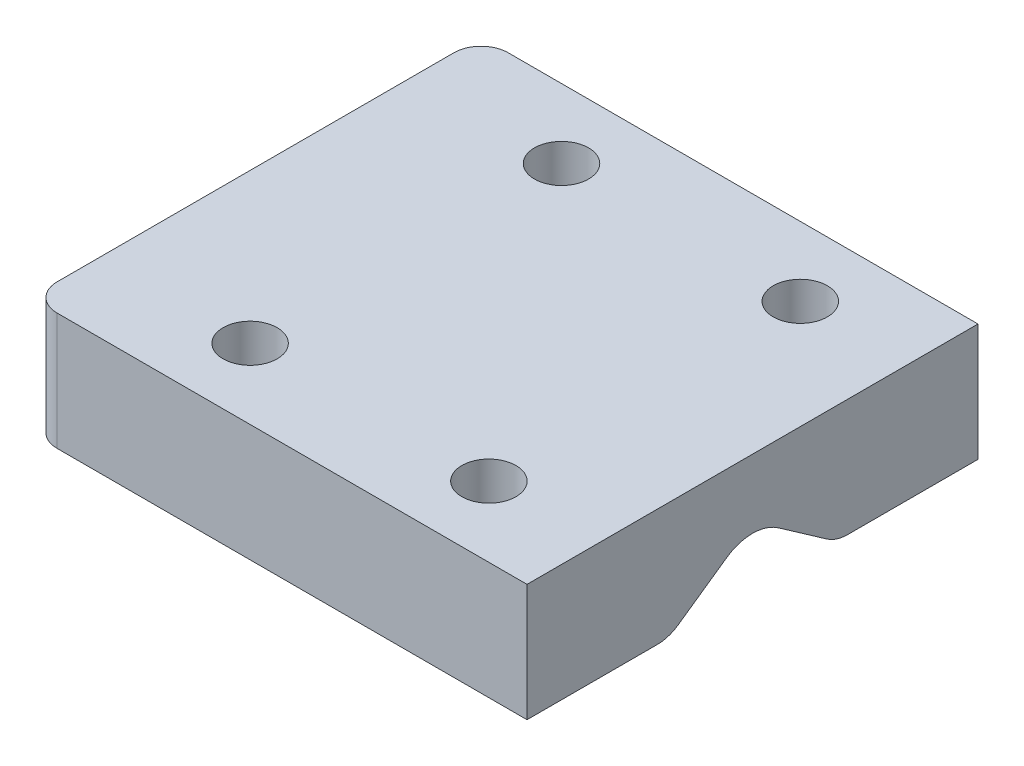
ISO-10303-21;
HEADER;
FILE_DESCRIPTION(('STEP AP214'),'2;1');
FILE_NAME('part.step','',(''),(''),'','','');
FILE_SCHEMA(('AUTOMOTIVE_DESIGN { 1 0 10303 214 1 1 1 1 }'));
ENDSEC;
DATA;
#1=APPLICATION_CONTEXT('core data for automotive mechanical design processes');
#2=APPLICATION_PROTOCOL_DEFINITION('international standard','automotive_design',2000,#1);
#3=PRODUCT_CONTEXT('',#1,'mechanical');
#4=PRODUCT('Part','Part','',(#3));
#5=PRODUCT_RELATED_PRODUCT_CATEGORY('part','',(#4));
#6=PRODUCT_DEFINITION_FORMATION('','',#4);
#7=PRODUCT_DEFINITION_CONTEXT('part definition',#1,'design');
#8=PRODUCT_DEFINITION('design','',#6,#7);
#9=PRODUCT_DEFINITION_SHAPE('','',#8);
#10=(LENGTH_UNIT() NAMED_UNIT(*) SI_UNIT(.MILLI.,.METRE.));
#11=(NAMED_UNIT(*) PLANE_ANGLE_UNIT() SI_UNIT($,.RADIAN.));
#12=(NAMED_UNIT(*) SI_UNIT($,.STERADIAN.) SOLID_ANGLE_UNIT());
#13=UNCERTAINTY_MEASURE_WITH_UNIT(LENGTH_MEASURE(1.E-05),#10,'distance_accuracy_value','');
#14=(GEOMETRIC_REPRESENTATION_CONTEXT(3) GLOBAL_UNCERTAINTY_ASSIGNED_CONTEXT((#13)) GLOBAL_UNIT_ASSIGNED_CONTEXT((#10,
#11,#12)) REPRESENTATION_CONTEXT('',''));
#15=CARTESIAN_POINT('',(0.,0.,0.));
#16=DIRECTION('',(0.,0.,1.));
#17=DIRECTION('',(1.,0.,0.));
#18=AXIS2_PLACEMENT_3D('',#15,#16,#17);
#19=CARTESIAN_POINT('',(0.,68.,0.));
#20=DIRECTION('',(0.,-1.,0.));
#21=DIRECTION('',(0.,0.,-1.));
#22=AXIS2_PLACEMENT_3D('',#19,#20,#21);
#23=PLANE('',#22);
#24=CARTESIAN_POINT('',(15.4737437034702,68.,-17.3243369322658));
#25=DIRECTION('',(0.,1.,0.));
#26=DIRECTION('',(0.,0.,1.));
#27=AXIS2_PLACEMENT_3D('',#24,#25,#26);
#28=CIRCLE('',#27,3.);
#29=CARTESIAN_POINT('',(15.4737437034702,68.,-14.3243369322658));
#30=VERTEX_POINT('',#29);
#31=EDGE_CURVE('E244',#30,#30,#28,.T.);
#32=ORIENTED_EDGE('',*,*,#31,.T.);
#33=EDGE_LOOP('',(#32));
#34=FACE_BOUND('',#33,.T.);
#35=CARTESIAN_POINT('',(-11.,68.,-17.3243369322658));
#36=DIRECTION('',(0.,1.,0.));
#37=DIRECTION('',(0.,0.,1.));
#38=AXIS2_PLACEMENT_3D('',#35,#36,#37);
#39=CIRCLE('',#38,3.);
#40=CARTESIAN_POINT('',(-11.,68.,-14.3243369322658));
#41=VERTEX_POINT('',#40);
#42=EDGE_CURVE('E245',#41,#41,#39,.T.);
#43=ORIENTED_EDGE('',*,*,#42,.T.);
#44=EDGE_LOOP('',(#43));
#45=FACE_BOUND('',#44,.T.);
#46=DIRECTION('',(0.,0.,-1.));
#47=VECTOR('',#46,1.);
#48=CARTESIAN_POINT('',(27.5,68.,-25.));
#49=LINE('',#48,#47);
#50=CARTESIAN_POINT('',(27.5,68.,-10.5441571993397));
#51=VERTEX_POINT('',#50);
#52=CARTESIAN_POINT('',(27.5,68.,-25.));
#53=VERTEX_POINT('',#52);
#54=EDGE_CURVE('E149',#51,#53,#49,.T.);
#55=ORIENTED_EDGE('',*,*,#54,.F.);
#56=DIRECTION('',(1.,0.,0.));
#57=VECTOR('',#56,1.);
#58=CARTESIAN_POINT('',(-27.5972353458108,68.,-10.5441571993397));
#59=LINE('',#58,#57);
#60=CARTESIAN_POINT('',(-27.5972353458108,68.,-10.5441571993397));
#61=VERTEX_POINT('',#60);
#62=EDGE_CURVE('E192',#51,#61,#59,.F.);
#63=ORIENTED_EDGE('',*,*,#62,.T.);
#64=DIRECTION('',(0.,0.,1.));
#65=VECTOR('',#64,1.);
#66=CARTESIAN_POINT('',(-27.5972353458108,68.,-25.));
#67=LINE('',#66,#65);
#68=CARTESIAN_POINT('',(-27.5972353458108,68.,-22.));
#69=VERTEX_POINT('',#68);
#70=EDGE_CURVE('E214',#69,#61,#67,.T.);
#71=ORIENTED_EDGE('',*,*,#70,.F.);
#72=CARTESIAN_POINT('',(-24.5972353458108,68.,-22.));
#73=DIRECTION('',(0.,-1.,0.));
#74=DIRECTION('',(0.,0.,-1.));
#75=AXIS2_PLACEMENT_3D('',#72,#73,#74);
#76=CIRCLE('',#75,3.);
#77=CARTESIAN_POINT('',(-24.5972353458108,68.,-25.));
#78=VERTEX_POINT('',#77);
#79=EDGE_CURVE('E171',#69,#78,#76,.T.);
#80=ORIENTED_EDGE('',*,*,#79,.T.);
#81=DIRECTION('',(-1.,0.,0.));
#82=VECTOR('',#81,1.);
#83=CARTESIAN_POINT('',(27.5,68.,-25.));
#84=LINE('',#83,#82);
#85=EDGE_CURVE('E207',#53,#78,#84,.T.);
#86=ORIENTED_EDGE('',*,*,#85,.F.);
#87=EDGE_LOOP('',(#55,#63,#71,#80,#86));
#88=FACE_BOUND('',#87,.T.);
#89=ADVANCED_FACE('F34',(#34,#45,#88),#23,.T.);
#90=CARTESIAN_POINT('',(27.5,81.,-25.));
#91=DIRECTION('',(-1.,0.,0.));
#92=DIRECTION('',(0.,0.,1.));
#93=AXIS2_PLACEMENT_3D('',#90,#91,#92);
#94=PLANE('',#93);
#95=DIRECTION('',(0.,0.573576436351044,0.819152044288993));
#96=VECTOR('',#95,1.);
#97=CARTESIAN_POINT('',(27.5,74.5,0.));
#98=LINE('',#97,#96);
#99=CARTESIAN_POINT('',(27.5,68.723391822844,-8.24985145393554));
#100=VERTEX_POINT('',#99);
#101=CARTESIAN_POINT('',(27.5,72.4918872776377,-2.86788218175522));
#102=VERTEX_POINT('',#101);
#103=EDGE_CURVE('E230',#100,#102,#98,.T.);
#104=ORIENTED_EDGE('',*,*,#103,.F.);
#105=CARTESIAN_POINT('',(27.5,72.,-10.5441571993397));
#106=DIRECTION('',(-1.,0.,0.));
#107=DIRECTION('',(0.,0.,1.));
#108=AXIS2_PLACEMENT_3D('',#105,#106,#107);
#109=CIRCLE('',#108,4.);
#110=EDGE_CURVE('E190',#100,#51,#109,.F.);
#111=ORIENTED_EDGE('',*,*,#110,.T.);
#112=ORIENTED_EDGE('',*,*,#54,.T.);
#113=DIRECTION('',(0.,-1.,0.));
#114=VECTOR('',#113,1.);
#115=CARTESIAN_POINT('',(27.5,81.,-25.));
#116=LINE('',#115,#114);
#117=CARTESIAN_POINT('',(27.5,81.,-25.));
#118=VERTEX_POINT('',#117);
#119=EDGE_CURVE('E128',#118,#53,#116,.T.);
#120=ORIENTED_EDGE('',*,*,#119,.F.);
#121=DIRECTION('',(0.,0.,-1.));
#122=VECTOR('',#121,1.);
#123=CARTESIAN_POINT('',(27.5,81.,-25.));
#124=LINE('',#123,#122);
#125=CARTESIAN_POINT('',(27.5,81.,25.));
#126=VERTEX_POINT('',#125);
#127=EDGE_CURVE('E134',#126,#118,#124,.T.);
#128=ORIENTED_EDGE('',*,*,#127,.F.);
#129=DIRECTION('',(0.,-1.,0.));
#130=VECTOR('',#129,1.);
#131=CARTESIAN_POINT('',(27.5,81.,25.));
#132=LINE('',#131,#130);
#133=CARTESIAN_POINT('',(27.5,68.,25.));
#134=VERTEX_POINT('',#133);
#135=EDGE_CURVE('E152',#126,#134,#132,.T.);
#136=ORIENTED_EDGE('',*,*,#135,.T.);
#137=CARTESIAN_POINT('',(27.5,68.,10.5441571993397));
#138=VERTEX_POINT('',#137);
#139=EDGE_CURVE('E203',#134,#138,#49,.T.);
#140=ORIENTED_EDGE('',*,*,#139,.T.);
#141=CARTESIAN_POINT('',(27.5,72.,10.5441571993397));
#142=DIRECTION('',(-1.,0.,0.));
#143=DIRECTION('',(0.,0.,1.));
#144=AXIS2_PLACEMENT_3D('',#141,#142,#143);
#145=CIRCLE('',#144,4.);
#146=CARTESIAN_POINT('',(27.5,68.723391822844,8.24985145393554));
#147=VERTEX_POINT('',#146);
#148=EDGE_CURVE('E188',#138,#147,#145,.F.);
#149=ORIENTED_EDGE('',*,*,#148,.T.);
#150=DIRECTION('',(0.,-0.573576436351044,0.819152044288993));
#151=VECTOR('',#150,1.);
#152=CARTESIAN_POINT('',(27.5,74.5,0.));
#153=LINE('',#152,#151);
#154=CARTESIAN_POINT('',(27.5,72.4918872776377,2.86788218175521));
#155=VERTEX_POINT('',#154);
#156=EDGE_CURVE('E227',#155,#147,#153,.T.);
#157=ORIENTED_EDGE('',*,*,#156,.F.);
#158=CARTESIAN_POINT('',(27.5,68.3961270561927,0.));
#159=DIRECTION('',(-1.,0.,0.));
#160=DIRECTION('',(0.,0.,1.));
#161=AXIS2_PLACEMENT_3D('',#158,#159,#160);
#162=CIRCLE('',#161,5.);
#163=EDGE_CURVE('E180',#155,#102,#162,.T.);
#164=ORIENTED_EDGE('',*,*,#163,.T.);
#165=EDGE_LOOP('',(#104,#111,#112,#120,#128,#136,#140,#149,#157,#164));
#166=FACE_BOUND('',#165,.T.);
#167=ADVANCED_FACE('F147',(#166),#94,.F.);
#168=CARTESIAN_POINT('',(27.5,81.,-25.));
#169=DIRECTION('',(0.,0.,1.));
#170=DIRECTION('',(1.,0.,0.));
#171=AXIS2_PLACEMENT_3D('',#168,#169,#170);
#172=PLANE('',#171);
#173=ORIENTED_EDGE('',*,*,#85,.T.);
#174=DIRECTION('',(0.,-1.,0.));
#175=VECTOR('',#174,1.);
#176=CARTESIAN_POINT('',(-24.5972353458108,81.,-25.));
#177=LINE('',#176,#175);
#178=CARTESIAN_POINT('',(-24.5972353458108,81.,-25.));
#179=VERTEX_POINT('',#178);
#180=EDGE_CURVE('E130',#78,#179,#177,.F.);
#181=ORIENTED_EDGE('',*,*,#180,.T.);
#182=DIRECTION('',(-1.,0.,0.));
#183=VECTOR('',#182,1.);
#184=CARTESIAN_POINT('',(27.5,81.,-25.));
#185=LINE('',#184,#183);
#186=EDGE_CURVE('E123',#118,#179,#185,.T.);
#187=ORIENTED_EDGE('',*,*,#186,.F.);
#188=ORIENTED_EDGE('',*,*,#119,.T.);
#189=EDGE_LOOP('',(#173,#181,#187,#188));
#190=FACE_BOUND('',#189,.T.);
#191=ADVANCED_FACE('F126',(#190),#172,.F.);
#192=CARTESIAN_POINT('',(-27.5972353458108,81.,-25.));
#193=DIRECTION('',(1.,0.,0.));
#194=DIRECTION('',(0.,0.,-1.));
#195=AXIS2_PLACEMENT_3D('',#192,#193,#194);
#196=PLANE('',#195);
#197=ORIENTED_EDGE('',*,*,#70,.T.);
#198=CARTESIAN_POINT('',(-27.5972353458108,72.,-10.5441571993397));
#199=DIRECTION('',(1.,0.,0.));
#200=DIRECTION('',(0.,0.,-1.));
#201=AXIS2_PLACEMENT_3D('',#198,#199,#200);
#202=CIRCLE('',#201,4.);
#203=CARTESIAN_POINT('',(-27.5972353458108,68.723391822844,-8.24985145393553));
#204=VERTEX_POINT('',#203);
#205=EDGE_CURVE('E195',#61,#204,#202,.F.);
#206=ORIENTED_EDGE('',*,*,#205,.T.);
#207=DIRECTION('',(0.,0.573576436351044,0.819152044288993));
#208=VECTOR('',#207,1.);
#209=CARTESIAN_POINT('',(-27.5972353458108,74.5,0.));
#210=LINE('',#209,#208);
#211=CARTESIAN_POINT('',(-27.5972353458108,72.4918872776377,-2.86788218175521));
#212=VERTEX_POINT('',#211);
#213=EDGE_CURVE('E229',#204,#212,#210,.T.);
#214=ORIENTED_EDGE('',*,*,#213,.T.);
#215=CARTESIAN_POINT('',(-27.5972353458108,68.3961270561927,0.));
#216=DIRECTION('',(1.,0.,0.));
#217=DIRECTION('',(0.,0.,-1.));
#218=AXIS2_PLACEMENT_3D('',#215,#216,#217);
#219=CIRCLE('',#218,5.);
#220=CARTESIAN_POINT('',(-27.5972353458108,72.4918872776377,2.86788218175522));
#221=VERTEX_POINT('',#220);
#222=EDGE_CURVE('E183',#212,#221,#219,.T.);
#223=ORIENTED_EDGE('',*,*,#222,.T.);
#224=DIRECTION('',(0.,-0.573576436351044,0.819152044288993));
#225=VECTOR('',#224,1.);
#226=CARTESIAN_POINT('',(-27.5972353458108,74.5,0.));
#227=LINE('',#226,#225);
#228=CARTESIAN_POINT('',(-27.5972353458108,68.723391822844,8.24985145393554));
#229=VERTEX_POINT('',#228);
#230=EDGE_CURVE('E210',#221,#229,#227,.T.);
#231=ORIENTED_EDGE('',*,*,#230,.T.);
#232=CARTESIAN_POINT('',(-27.5972353458108,72.,10.5441571993397));
#233=DIRECTION('',(1.,0.,0.));
#234=DIRECTION('',(0.,0.,-1.));
#235=AXIS2_PLACEMENT_3D('',#232,#233,#234);
#236=CIRCLE('',#235,4.);
#237=CARTESIAN_POINT('',(-27.5972353458108,68.,10.5441571993397));
#238=VERTEX_POINT('',#237);
#239=EDGE_CURVE('E54',#229,#238,#236,.F.);
#240=ORIENTED_EDGE('',*,*,#239,.T.);
#241=CARTESIAN_POINT('',(-27.5972353458108,68.,22.));
#242=VERTEX_POINT('',#241);
#243=EDGE_CURVE('E204',#238,#242,#67,.T.);
#244=ORIENTED_EDGE('',*,*,#243,.T.);
#245=DIRECTION('',(0.,-1.,0.));
#246=VECTOR('',#245,1.);
#247=CARTESIAN_POINT('',(-27.5972353458108,81.,22.));
#248=LINE('',#247,#246);
#249=CARTESIAN_POINT('',(-27.5972353458108,81.,22.));
#250=VERTEX_POINT('',#249);
#251=EDGE_CURVE('E165',#242,#250,#248,.F.);
#252=ORIENTED_EDGE('',*,*,#251,.T.);
#253=DIRECTION('',(0.,0.,1.));
#254=VECTOR('',#253,1.);
#255=CARTESIAN_POINT('',(-27.5972353458108,81.,-25.));
#256=LINE('',#255,#254);
#257=CARTESIAN_POINT('',(-27.5972353458108,81.,-22.));
#258=VERTEX_POINT('',#257);
#259=EDGE_CURVE('E133',#258,#250,#256,.T.);
#260=ORIENTED_EDGE('',*,*,#259,.F.);
#261=DIRECTION('',(0.,-1.,0.));
#262=VECTOR('',#261,1.);
#263=CARTESIAN_POINT('',(-27.5972353458108,81.,-22.));
#264=LINE('',#263,#262);
#265=EDGE_CURVE('E162',#258,#69,#264,.T.);
#266=ORIENTED_EDGE('',*,*,#265,.T.);
#267=EDGE_LOOP('',(#197,#206,#214,#223,#231,#240,#244,#252,#260,#266));
#268=FACE_BOUND('',#267,.T.);
#269=ADVANCED_FACE('F224',(#268),#196,.F.);
#270=CARTESIAN_POINT('',(27.5,81.,25.));
#271=DIRECTION('',(0.,0.,-1.));
#272=DIRECTION('',(-1.,0.,0.));
#273=AXIS2_PLACEMENT_3D('',#270,#271,#272);
#274=PLANE('',#273);
#275=DIRECTION('',(1.,0.,0.));
#276=VECTOR('',#275,1.);
#277=CARTESIAN_POINT('',(27.5,81.,25.));
#278=LINE('',#277,#276);
#279=CARTESIAN_POINT('',(-24.5972353458108,81.,25.));
#280=VERTEX_POINT('',#279);
#281=EDGE_CURVE('E140',#280,#126,#278,.T.);
#282=ORIENTED_EDGE('',*,*,#281,.F.);
#283=DIRECTION('',(0.,-1.,0.));
#284=VECTOR('',#283,1.);
#285=CARTESIAN_POINT('',(-24.5972353458108,81.,25.));
#286=LINE('',#285,#284);
#287=CARTESIAN_POINT('',(-24.5972353458108,68.,25.));
#288=VERTEX_POINT('',#287);
#289=EDGE_CURVE('E151',#280,#288,#286,.T.);
#290=ORIENTED_EDGE('',*,*,#289,.T.);
#291=DIRECTION('',(1.,0.,0.));
#292=VECTOR('',#291,1.);
#293=CARTESIAN_POINT('',(27.5,68.,25.));
#294=LINE('',#293,#292);
#295=EDGE_CURVE('E144',#288,#134,#294,.T.);
#296=ORIENTED_EDGE('',*,*,#295,.T.);
#297=ORIENTED_EDGE('',*,*,#135,.F.);
#298=EDGE_LOOP('',(#282,#290,#296,#297));
#299=FACE_BOUND('',#298,.T.);
#300=ADVANCED_FACE('F217',(#299),#274,.F.);
#301=CARTESIAN_POINT('',(0.,81.,0.));
#302=DIRECTION('',(0.,-1.,0.));
#303=DIRECTION('',(0.,0.,-1.));
#304=AXIS2_PLACEMENT_3D('',#301,#302,#303);
#305=PLANE('',#304);
#306=CARTESIAN_POINT('',(-11.,81.,17.201232434968));
#307=DIRECTION('',(0.,1.,0.));
#308=DIRECTION('',(0.,0.,1.));
#309=AXIS2_PLACEMENT_3D('',#306,#307,#308);
#310=CIRCLE('',#309,3.);
#311=CARTESIAN_POINT('',(-11.,81.,20.201232434968));
#312=VERTEX_POINT('',#311);
#313=EDGE_CURVE('E248',#312,#312,#310,.T.);
#314=ORIENTED_EDGE('',*,*,#313,.F.);
#315=EDGE_LOOP('',(#314));
#316=FACE_BOUND('',#315,.T.);
#317=CARTESIAN_POINT('',(15.4737437034702,81.,-17.3243369322658));
#318=DIRECTION('',(0.,1.,0.));
#319=DIRECTION('',(0.,0.,1.));
#320=AXIS2_PLACEMENT_3D('',#317,#318,#319);
#321=CIRCLE('',#320,3.);
#322=CARTESIAN_POINT('',(15.4737437034702,81.,-14.3243369322658));
#323=VERTEX_POINT('',#322);
#324=EDGE_CURVE('E241',#323,#323,#321,.T.);
#325=ORIENTED_EDGE('',*,*,#324,.F.);
#326=EDGE_LOOP('',(#325));
#327=FACE_BOUND('',#326,.T.);
#328=CARTESIAN_POINT('',(-11.,81.,-17.3243369322658));
#329=DIRECTION('',(0.,1.,0.));
#330=DIRECTION('',(0.,0.,1.));
#331=AXIS2_PLACEMENT_3D('',#328,#329,#330);
#332=CIRCLE('',#331,3.);
#333=CARTESIAN_POINT('',(-11.,81.,-14.3243369322658));
#334=VERTEX_POINT('',#333);
#335=EDGE_CURVE('E253',#334,#334,#332,.T.);
#336=ORIENTED_EDGE('',*,*,#335,.F.);
#337=EDGE_LOOP('',(#336));
#338=FACE_BOUND('',#337,.T.);
#339=CARTESIAN_POINT('',(15.4737437034702,81.,17.2012324349681));
#340=DIRECTION('',(0.,1.,0.));
#341=DIRECTION('',(0.,0.,1.));
#342=AXIS2_PLACEMENT_3D('',#339,#340,#341);
#343=CIRCLE('',#342,3.);
#344=CARTESIAN_POINT('',(15.4737437034702,81.,20.2012324349681));
#345=VERTEX_POINT('',#344);
#346=EDGE_CURVE('E235',#345,#345,#343,.T.);
#347=ORIENTED_EDGE('',*,*,#346,.F.);
#348=EDGE_LOOP('',(#347));
#349=FACE_BOUND('',#348,.T.);
#350=ORIENTED_EDGE('',*,*,#259,.T.);
#351=CARTESIAN_POINT('',(-24.5972353458108,81.,22.));
#352=DIRECTION('',(0.,-1.,0.));
#353=DIRECTION('',(0.,0.,-1.));
#354=AXIS2_PLACEMENT_3D('',#351,#352,#353);
#355=CIRCLE('',#354,3.);
#356=EDGE_CURVE('E169',#250,#280,#355,.F.);
#357=ORIENTED_EDGE('',*,*,#356,.T.);
#358=ORIENTED_EDGE('',*,*,#281,.T.);
#359=ORIENTED_EDGE('',*,*,#127,.T.);
#360=ORIENTED_EDGE('',*,*,#186,.T.);
#361=CARTESIAN_POINT('',(-24.5972353458108,81.,-22.));
#362=DIRECTION('',(0.,-1.,0.));
#363=DIRECTION('',(0.,0.,-1.));
#364=AXIS2_PLACEMENT_3D('',#361,#362,#363);
#365=CIRCLE('',#364,3.);
#366=EDGE_CURVE('E167',#179,#258,#365,.F.);
#367=ORIENTED_EDGE('',*,*,#366,.T.);
#368=EDGE_LOOP('',(#350,#357,#358,#359,#360,#367));
#369=FACE_BOUND('',#368,.T.);
#370=ADVANCED_FACE('F138',(#316,#327,#338,#349,#369),#305,.F.);
#371=CARTESIAN_POINT('',(-11.,68.,17.201232434968));
#372=DIRECTION('',(0.,1.,0.));
#373=DIRECTION('',(0.,0.,1.));
#374=AXIS2_PLACEMENT_3D('',#371,#372,#373);
#375=CIRCLE('',#374,3.);
#376=CARTESIAN_POINT('',(-11.,68.,20.201232434968));
#377=VERTEX_POINT('',#376);
#378=EDGE_CURVE('E238',#377,#377,#375,.T.);
#379=ORIENTED_EDGE('',*,*,#378,.T.);
#380=EDGE_LOOP('',(#379));
#381=FACE_BOUND('',#380,.T.);
#382=CARTESIAN_POINT('',(15.4737437034702,68.,17.2012324349681));
#383=DIRECTION('',(0.,1.,0.));
#384=DIRECTION('',(0.,0.,1.));
#385=AXIS2_PLACEMENT_3D('',#382,#383,#384);
#386=CIRCLE('',#385,3.);
#387=CARTESIAN_POINT('',(15.4737437034702,68.,20.2012324349681));
#388=VERTEX_POINT('',#387);
#389=EDGE_CURVE('E232',#388,#388,#386,.T.);
#390=ORIENTED_EDGE('',*,*,#389,.T.);
#391=EDGE_LOOP('',(#390));
#392=FACE_BOUND('',#391,.T.);
#393=ORIENTED_EDGE('',*,*,#243,.F.);
#394=DIRECTION('',(1.,0.,0.));
#395=VECTOR('',#394,1.);
#396=CARTESIAN_POINT('',(27.5,68.,10.5441571993397));
#397=LINE('',#396,#395);
#398=EDGE_CURVE('E42',#238,#138,#397,.T.);
#399=ORIENTED_EDGE('',*,*,#398,.T.);
#400=ORIENTED_EDGE('',*,*,#139,.F.);
#401=ORIENTED_EDGE('',*,*,#295,.F.);
#402=CARTESIAN_POINT('',(-24.5972353458108,68.,22.));
#403=DIRECTION('',(0.,-1.,0.));
#404=DIRECTION('',(0.,0.,-1.));
#405=AXIS2_PLACEMENT_3D('',#402,#403,#404);
#406=CIRCLE('',#405,3.);
#407=EDGE_CURVE('E155',#288,#242,#406,.T.);
#408=ORIENTED_EDGE('',*,*,#407,.T.);
#409=EDGE_LOOP('',(#393,#399,#400,#401,#408));
#410=FACE_BOUND('',#409,.T.);
#411=ADVANCED_FACE('F201',(#381,#392,#410),#23,.T.);
#412=CARTESIAN_POINT('',(-27.5972353458108,74.5,0.));
#413=DIRECTION('',(0.,0.819152044288993,-0.573576436351044));
#414=DIRECTION('',(0.,0.573576436351044,0.819152044288993));
#415=AXIS2_PLACEMENT_3D('',#412,#413,#414);
#416=PLANE('',#415);
#417=ORIENTED_EDGE('',*,*,#213,.F.);
#418=DIRECTION('',(1.,0.,0.));
#419=VECTOR('',#418,1.);
#420=CARTESIAN_POINT('',(27.5,68.723391822844,-8.24985145393554));
#421=LINE('',#420,#419);
#422=EDGE_CURVE('E185',#204,#100,#421,.T.);
#423=ORIENTED_EDGE('',*,*,#422,.T.);
#424=ORIENTED_EDGE('',*,*,#103,.T.);
#425=DIRECTION('',(1.,0.,0.));
#426=VECTOR('',#425,1.);
#427=CARTESIAN_POINT('',(-27.5972353458108,72.4918872776377,-2.86788218175521));
#428=LINE('',#427,#426);
#429=EDGE_CURVE('E177',#102,#212,#428,.F.);
#430=ORIENTED_EDGE('',*,*,#429,.T.);
#431=EDGE_LOOP('',(#417,#423,#424,#430));
#432=FACE_BOUND('',#431,.T.);
#433=ADVANCED_FACE('F300',(#432),#416,.F.);
#434=CARTESIAN_POINT('',(-27.5972353458108,74.5,0.));
#435=DIRECTION('',(0.,0.819152044288993,0.573576436351044));
#436=DIRECTION('',(0.,-0.573576436351044,0.819152044288993));
#437=AXIS2_PLACEMENT_3D('',#434,#435,#436);
#438=PLANE('',#437);
#439=ORIENTED_EDGE('',*,*,#156,.T.);
#440=DIRECTION('',(1.,0.,0.));
#441=VECTOR('',#440,1.);
#442=CARTESIAN_POINT('',(-27.5972353458108,68.723391822844,8.24985145393554));
#443=LINE('',#442,#441);
#444=EDGE_CURVE('E11',#147,#229,#443,.F.);
#445=ORIENTED_EDGE('',*,*,#444,.T.);
#446=ORIENTED_EDGE('',*,*,#230,.F.);
#447=DIRECTION('',(1.,0.,0.));
#448=VECTOR('',#447,1.);
#449=CARTESIAN_POINT('',(27.5,72.4918872776377,2.86788218175522));
#450=LINE('',#449,#448);
#451=EDGE_CURVE('E174',#221,#155,#450,.T.);
#452=ORIENTED_EDGE('',*,*,#451,.T.);
#453=EDGE_LOOP('',(#439,#445,#446,#452));
#454=FACE_BOUND('',#453,.T.);
#455=ADVANCED_FACE('F305',(#454),#438,.F.);
#456=CARTESIAN_POINT('',(-24.5972353458108,81.,22.));
#457=DIRECTION('',(0.,-1.,0.));
#458=DIRECTION('',(0.,0.,-1.));
#459=AXIS2_PLACEMENT_3D('',#456,#457,#458);
#460=CYLINDRICAL_SURFACE('',#459,3.);
#461=ORIENTED_EDGE('',*,*,#356,.F.);
#462=ORIENTED_EDGE('',*,*,#251,.F.);
#463=ORIENTED_EDGE('',*,*,#407,.F.);
#464=ORIENTED_EDGE('',*,*,#289,.F.);
#465=EDGE_LOOP('',(#461,#462,#463,#464));
#466=FACE_BOUND('',#465,.T.);
#467=ADVANCED_FACE('F222',(#466),#460,.T.);
#468=CARTESIAN_POINT('',(-24.5972353458108,81.,-22.));
#469=DIRECTION('',(0.,-1.,0.));
#470=DIRECTION('',(0.,0.,-1.));
#471=AXIS2_PLACEMENT_3D('',#468,#469,#470);
#472=CYLINDRICAL_SURFACE('',#471,3.);
#473=ORIENTED_EDGE('',*,*,#366,.F.);
#474=ORIENTED_EDGE('',*,*,#180,.F.);
#475=ORIENTED_EDGE('',*,*,#79,.F.);
#476=ORIENTED_EDGE('',*,*,#265,.F.);
#477=EDGE_LOOP('',(#473,#474,#475,#476));
#478=FACE_BOUND('',#477,.T.);
#479=ADVANCED_FACE('F277',(#478),#472,.T.);
#480=CARTESIAN_POINT('',(15.4737437034702,68.,17.2012324349681));
#481=DIRECTION('',(0.,1.,0.));
#482=DIRECTION('',(0.,0.,1.));
#483=AXIS2_PLACEMENT_3D('',#480,#481,#482);
#484=CYLINDRICAL_SURFACE('',#483,3.);
#485=ORIENTED_EDGE('',*,*,#389,.F.);
#486=EDGE_LOOP('',(#485));
#487=FACE_BOUND('',#486,.T.);
#488=ORIENTED_EDGE('',*,*,#346,.T.);
#489=EDGE_LOOP('',(#488));
#490=FACE_BOUND('',#489,.T.);
#491=ADVANCED_FACE('F275',(#487,#490),#484,.F.);
#492=CARTESIAN_POINT('',(-11.,68.,17.201232434968));
#493=DIRECTION('',(0.,1.,0.));
#494=DIRECTION('',(0.,0.,1.));
#495=AXIS2_PLACEMENT_3D('',#492,#493,#494);
#496=CYLINDRICAL_SURFACE('',#495,3.);
#497=ORIENTED_EDGE('',*,*,#378,.F.);
#498=EDGE_LOOP('',(#497));
#499=FACE_BOUND('',#498,.T.);
#500=ORIENTED_EDGE('',*,*,#313,.T.);
#501=EDGE_LOOP('',(#500));
#502=FACE_BOUND('',#501,.T.);
#503=ADVANCED_FACE('F265',(#499,#502),#496,.F.);
#504=CARTESIAN_POINT('',(-11.,68.,-17.3243369322658));
#505=DIRECTION('',(0.,1.,0.));
#506=DIRECTION('',(0.,0.,1.));
#507=AXIS2_PLACEMENT_3D('',#504,#505,#506);
#508=CYLINDRICAL_SURFACE('',#507,3.);
#509=ORIENTED_EDGE('',*,*,#42,.F.);
#510=EDGE_LOOP('',(#509));
#511=FACE_BOUND('',#510,.T.);
#512=ORIENTED_EDGE('',*,*,#335,.T.);
#513=EDGE_LOOP('',(#512));
#514=FACE_BOUND('',#513,.T.);
#515=ADVANCED_FACE('F261',(#511,#514),#508,.F.);
#516=CARTESIAN_POINT('',(15.4737437034702,68.,-17.3243369322658));
#517=DIRECTION('',(0.,1.,0.));
#518=DIRECTION('',(0.,0.,1.));
#519=AXIS2_PLACEMENT_3D('',#516,#517,#518);
#520=CYLINDRICAL_SURFACE('',#519,3.);
#521=ORIENTED_EDGE('',*,*,#31,.F.);
#522=EDGE_LOOP('',(#521));
#523=FACE_BOUND('',#522,.T.);
#524=ORIENTED_EDGE('',*,*,#324,.T.);
#525=EDGE_LOOP('',(#524));
#526=FACE_BOUND('',#525,.T.);
#527=ADVANCED_FACE('F264',(#523,#526),#520,.F.);
#528=CARTESIAN_POINT('',(-27.5972353458108,68.3961270561927,0.));
#529=DIRECTION('',(-1.,0.,0.));
#530=DIRECTION('',(0.,0.,1.));
#531=AXIS2_PLACEMENT_3D('',#528,#529,#530);
#532=CYLINDRICAL_SURFACE('',#531,5.);
#533=ORIENTED_EDGE('',*,*,#222,.F.);
#534=ORIENTED_EDGE('',*,*,#429,.F.);
#535=ORIENTED_EDGE('',*,*,#163,.F.);
#536=ORIENTED_EDGE('',*,*,#451,.F.);
#537=EDGE_LOOP('',(#533,#534,#535,#536));
#538=FACE_BOUND('',#537,.T.);
#539=ADVANCED_FACE('F316',(#538),#532,.F.);
#540=CARTESIAN_POINT('',(-27.5972353458108,72.,-10.5441571993397));
#541=DIRECTION('',(-1.,0.,0.));
#542=DIRECTION('',(0.,0.,1.));
#543=AXIS2_PLACEMENT_3D('',#540,#541,#542);
#544=CYLINDRICAL_SURFACE('',#543,4.);
#545=ORIENTED_EDGE('',*,*,#205,.F.);
#546=ORIENTED_EDGE('',*,*,#62,.F.);
#547=ORIENTED_EDGE('',*,*,#110,.F.);
#548=ORIENTED_EDGE('',*,*,#422,.F.);
#549=EDGE_LOOP('',(#545,#546,#547,#548));
#550=FACE_BOUND('',#549,.T.);
#551=ADVANCED_FACE('F321',(#550),#544,.T.);
#552=CARTESIAN_POINT('',(0.,72.,10.5441571993397));
#553=DIRECTION('',(-1.,0.,0.));
#554=DIRECTION('',(0.,0.,1.));
#555=AXIS2_PLACEMENT_3D('',#552,#553,#554);
#556=CYLINDRICAL_SURFACE('',#555,4.);
#557=ORIENTED_EDGE('',*,*,#239,.F.);
#558=ORIENTED_EDGE('',*,*,#444,.F.);
#559=ORIENTED_EDGE('',*,*,#148,.F.);
#560=ORIENTED_EDGE('',*,*,#398,.F.);
#561=EDGE_LOOP('',(#557,#558,#559,#560));
#562=FACE_BOUND('',#561,.T.);
#563=ADVANCED_FACE('F36',(#562),#556,.T.);
#564=CLOSED_SHELL('',(#89,#167,#191,#269,#300,#370,#411,#433,#455,#467,#479,#491,#503,#515,#527,
#539,#551,#563));
#565=MANIFOLD_SOLID_BREP('B2',#564);
#566=ADVANCED_BREP_SHAPE_REPRESENTATION('',(#18,#565),#14);
#567=SHAPE_DEFINITION_REPRESENTATION(#9,#566);
ENDSEC;
END-ISO-10303-21;
